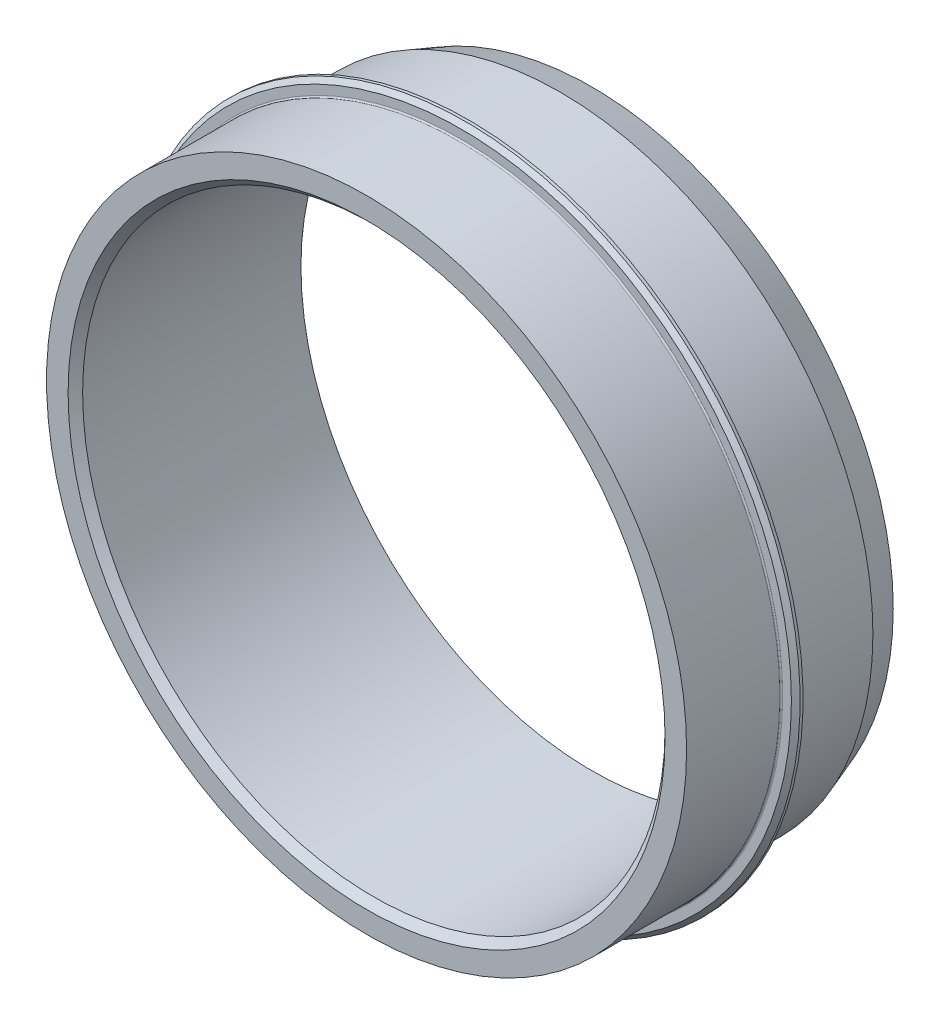
ISO-10303-21;
HEADER;
FILE_DESCRIPTION(('STEP AP214'),'2;1');
FILE_NAME('part.step','',(''),(''),'','','');
FILE_SCHEMA(('AUTOMOTIVE_DESIGN { 1 0 10303 214 1 1 1 1 }'));
ENDSEC;
DATA;
#1=APPLICATION_CONTEXT('core data for automotive mechanical design processes');
#2=APPLICATION_PROTOCOL_DEFINITION('international standard','automotive_design',2000,#1);
#3=PRODUCT_CONTEXT('',#1,'mechanical');
#4=PRODUCT('Part','Part','',(#3));
#5=PRODUCT_RELATED_PRODUCT_CATEGORY('part','',(#4));
#6=PRODUCT_DEFINITION_FORMATION('','',#4);
#7=PRODUCT_DEFINITION_CONTEXT('part definition',#1,'design');
#8=PRODUCT_DEFINITION('design','',#6,#7);
#9=PRODUCT_DEFINITION_SHAPE('','',#8);
#10=(LENGTH_UNIT() NAMED_UNIT(*) SI_UNIT(.MILLI.,.METRE.));
#11=(NAMED_UNIT(*) PLANE_ANGLE_UNIT() SI_UNIT($,.RADIAN.));
#12=(NAMED_UNIT(*) SI_UNIT($,.STERADIAN.) SOLID_ANGLE_UNIT());
#13=UNCERTAINTY_MEASURE_WITH_UNIT(LENGTH_MEASURE(1.E-05),#10,'distance_accuracy_value','');
#14=(GEOMETRIC_REPRESENTATION_CONTEXT(3) GLOBAL_UNCERTAINTY_ASSIGNED_CONTEXT((#13)) GLOBAL_UNIT_ASSIGNED_CONTEXT((#10,
#11,#12)) REPRESENTATION_CONTEXT('',''));
#15=CARTESIAN_POINT('',(0.,0.,0.));
#16=DIRECTION('',(0.,0.,1.));
#17=DIRECTION('',(1.,0.,0.));
#18=AXIS2_PLACEMENT_3D('',#15,#16,#17);
#19=CARTESIAN_POINT('',(0.,34.23,479.8));
#20=DIRECTION('',(0.,0.,1.));
#21=DIRECTION('',(-1.,0.,0.));
#22=AXIS2_PLACEMENT_3D('',#19,#20,#21);
#23=PLANE('',#22);
#24=CARTESIAN_POINT('',(0.,-11.75,479.8));
#25=DIRECTION('',(0.,0.,-1.));
#26=DIRECTION('',(1.,0.,0.));
#27=AXIS2_PLACEMENT_3D('',#24,#25,#26);
#28=CIRCLE('',#27,44.18);
#29=CARTESIAN_POINT('',(44.18,-11.75,479.8));
#30=VERTEX_POINT('',#29);
#31=EDGE_CURVE('E102',#30,#30,#28,.T.);
#32=ORIENTED_EDGE('',*,*,#31,.T.);
#33=EDGE_LOOP('',(#32));
#34=FACE_BOUND('',#33,.T.);
#35=CARTESIAN_POINT('',(0.,-11.75,479.8));
#36=DIRECTION('',(0.,0.,1.));
#37=DIRECTION('',(1.,0.,0.));
#38=AXIS2_PLACEMENT_3D('',#35,#36,#37);
#39=CIRCLE('',#38,45.38);
#40=CARTESIAN_POINT('',(-45.38,-11.75,479.8));
#41=VERTEX_POINT('',#40);
#42=EDGE_CURVE('E95',#41,#41,#39,.T.);
#43=ORIENTED_EDGE('',*,*,#42,.T.);
#44=EDGE_LOOP('',(#43));
#45=FACE_BOUND('',#44,.T.);
#46=ADVANCED_FACE('F17',(#34,#45),#23,.T.);
#47=CARTESIAN_POINT('',(0.,31.23,478.8));
#48=DIRECTION('',(0.,0.,-1.));
#49=DIRECTION('',(0.,-1.,0.));
#50=AXIS2_PLACEMENT_3D('',#47,#48,#49);
#51=PLANE('',#50);
#52=CARTESIAN_POINT('',(0.,-11.75,478.8));
#53=DIRECTION('',(0.,0.,-1.));
#54=DIRECTION('',(-1.,0.,0.));
#55=AXIS2_PLACEMENT_3D('',#52,#53,#54);
#56=CIRCLE('',#55,42.98);
#57=CARTESIAN_POINT('',(42.98,-11.75,478.8));
#58=VERTEX_POINT('',#57);
#59=EDGE_CURVE('E28',#58,#58,#56,.T.);
#60=ORIENTED_EDGE('',*,*,#59,.F.);
#61=EDGE_LOOP('',(#60));
#62=FACE_BOUND('',#61,.T.);
#63=CARTESIAN_POINT('',(0.,-11.75,478.8));
#64=DIRECTION('',(0.,0.,-1.));
#65=DIRECTION('',(-1.,0.,0.));
#66=AXIS2_PLACEMENT_3D('',#63,#64,#65);
#67=CIRCLE('',#66,45.98);
#68=CARTESIAN_POINT('',(-45.98,-11.75,478.8));
#69=VERTEX_POINT('',#68);
#70=EDGE_CURVE('E86',#69,#69,#67,.T.);
#71=ORIENTED_EDGE('',*,*,#70,.T.);
#72=EDGE_LOOP('',(#71));
#73=FACE_BOUND('',#72,.T.);
#74=ADVANCED_FACE('F147',(#62,#73),#51,.T.);
#75=CARTESIAN_POINT('',(0.,28.27,461.8));
#76=DIRECTION('',(0.,0.,-1.));
#77=DIRECTION('',(0.,-1.,0.));
#78=AXIS2_PLACEMENT_3D('',#75,#76,#77);
#79=PLANE('',#78);
#80=CARTESIAN_POINT('',(0.,-11.75,461.8));
#81=DIRECTION('',(0.,0.,-1.));
#82=DIRECTION('',(-1.,0.,0.));
#83=AXIS2_PLACEMENT_3D('',#80,#81,#82);
#84=CIRCLE('',#83,40.02);
#85=CARTESIAN_POINT('',(-40.02,-11.75,461.8));
#86=VERTEX_POINT('',#85);
#87=EDGE_CURVE('E11',#86,#86,#84,.T.);
#88=ORIENTED_EDGE('',*,*,#87,.F.);
#89=EDGE_LOOP('',(#88));
#90=FACE_BOUND('',#89,.T.);
#91=CARTESIAN_POINT('',(0.,-11.75,461.8));
#92=DIRECTION('',(0.,0.,-1.));
#93=DIRECTION('',(-1.,0.,0.));
#94=AXIS2_PLACEMENT_3D('',#91,#92,#93);
#95=CIRCLE('',#94,41.38);
#96=CARTESIAN_POINT('',(41.38,-11.75,461.8));
#97=VERTEX_POINT('',#96);
#98=EDGE_CURVE('E21',#97,#97,#95,.T.);
#99=ORIENTED_EDGE('',*,*,#98,.T.);
#100=EDGE_LOOP('',(#99));
#101=FACE_BOUND('',#100,.T.);
#102=ADVANCED_FACE('F125',(#90,#101),#79,.T.);
#103=CARTESIAN_POINT('',(0.,32.23,492.8));
#104=DIRECTION('',(0.,0.,1.));
#105=DIRECTION('',(-1.,0.,0.));
#106=AXIS2_PLACEMENT_3D('',#103,#104,#105);
#107=PLANE('',#106);
#108=CARTESIAN_POINT('',(0.,-11.75,492.8));
#109=DIRECTION('',(0.,0.,-1.));
#110=DIRECTION('',(1.,0.,0.));
#111=AXIS2_PLACEMENT_3D('',#108,#109,#110);
#112=CIRCLE('',#111,41.02);
#113=CARTESIAN_POINT('',(41.02,-11.75,492.8));
#114=VERTEX_POINT('',#113);
#115=EDGE_CURVE('E106',#114,#114,#112,.T.);
#116=ORIENTED_EDGE('',*,*,#115,.T.);
#117=EDGE_LOOP('',(#116));
#118=FACE_BOUND('',#117,.T.);
#119=CARTESIAN_POINT('',(0.,-11.75,492.8));
#120=DIRECTION('',(0.,0.,-1.));
#121=DIRECTION('',(-1.,0.,0.));
#122=AXIS2_PLACEMENT_3D('',#119,#120,#121);
#123=CIRCLE('',#122,43.98);
#124=CARTESIAN_POINT('',(43.98,-11.75,492.8));
#125=VERTEX_POINT('',#124);
#126=EDGE_CURVE('E82',#125,#125,#123,.T.);
#127=ORIENTED_EDGE('',*,*,#126,.F.);
#128=EDGE_LOOP('',(#127));
#129=FACE_BOUND('',#128,.T.);
#130=ADVANCED_FACE('F159',(#118,#129),#107,.T.);
#131=CARTESIAN_POINT('',(0.,-11.75,492.8));
#132=DIRECTION('',(0.,0.,-1.));
#133=DIRECTION('',(-1.,0.,0.));
#134=AXIS2_PLACEMENT_3D('',#131,#132,#133);
#135=CYLINDRICAL_SURFACE('',#134,40.02);
#136=ORIENTED_EDGE('',*,*,#87,.T.);
#137=EDGE_LOOP('',(#136));
#138=FACE_BOUND('',#137,.T.);
#139=CARTESIAN_POINT('',(0.,-11.75,491.8));
#140=DIRECTION('',(0.,0.,1.));
#141=DIRECTION('',(1.,0.,0.));
#142=AXIS2_PLACEMENT_3D('',#139,#140,#141);
#143=CIRCLE('',#142,40.02);
#144=CARTESIAN_POINT('',(40.02,-11.75,491.8));
#145=VERTEX_POINT('',#144);
#146=EDGE_CURVE('E103',#145,#145,#143,.T.);
#147=ORIENTED_EDGE('',*,*,#146,.T.);
#148=EDGE_LOOP('',(#147));
#149=FACE_BOUND('',#148,.T.);
#150=ADVANCED_FACE('F19',(#138,#149),#135,.F.);
#151=CARTESIAN_POINT('',(0.,-11.75,492.8));
#152=DIRECTION('',(0.,0.,-1.));
#153=DIRECTION('',(-1.,0.,0.));
#154=AXIS2_PLACEMENT_3D('',#151,#152,#153);
#155=CYLINDRICAL_SURFACE('',#154,42.98);
#156=CARTESIAN_POINT('',(0.,-11.75,466.195963871127));
#157=DIRECTION('',(0.,0.,1.));
#158=DIRECTION('',(-1.,0.,0.));
#159=AXIS2_PLACEMENT_3D('',#156,#157,#158);
#160=CIRCLE('',#159,42.98);
#161=CARTESIAN_POINT('',(42.98,-11.75,466.195963871127));
#162=VERTEX_POINT('',#161);
#163=EDGE_CURVE('E97',#162,#162,#160,.T.);
#164=ORIENTED_EDGE('',*,*,#163,.T.);
#165=EDGE_LOOP('',(#164));
#166=FACE_BOUND('',#165,.T.);
#167=ORIENTED_EDGE('',*,*,#59,.T.);
#168=EDGE_LOOP('',(#167));
#169=FACE_BOUND('',#168,.T.);
#170=ADVANCED_FACE('F165',(#166,#169),#155,.T.);
#171=CARTESIAN_POINT('',(0.,-11.75,492.8));
#172=DIRECTION('',(0.,0.,-1.));
#173=DIRECTION('',(-1.,0.,0.));
#174=AXIS2_PLACEMENT_3D('',#171,#172,#173);
#175=CYLINDRICAL_SURFACE('',#174,45.98);
#176=ORIENTED_EDGE('',*,*,#70,.F.);
#177=EDGE_LOOP('',(#176));
#178=FACE_BOUND('',#177,.T.);
#179=CARTESIAN_POINT('',(0.,-11.75,479.2));
#180=DIRECTION('',(0.,0.,-1.));
#181=DIRECTION('',(1.,0.,0.));
#182=AXIS2_PLACEMENT_3D('',#179,#180,#181);
#183=CIRCLE('',#182,45.98);
#184=CARTESIAN_POINT('',(-45.98,-11.75,479.2));
#185=VERTEX_POINT('',#184);
#186=EDGE_CURVE('E87',#185,#185,#183,.T.);
#187=ORIENTED_EDGE('',*,*,#186,.T.);
#188=EDGE_LOOP('',(#187));
#189=FACE_BOUND('',#188,.T.);
#190=ADVANCED_FACE('F157',(#178,#189),#175,.T.);
#191=CARTESIAN_POINT('',(0.,-11.75,492.8));
#192=DIRECTION('',(0.,0.,-1.));
#193=DIRECTION('',(-1.,0.,0.));
#194=AXIS2_PLACEMENT_3D('',#191,#192,#193);
#195=CYLINDRICAL_SURFACE('',#194,43.98);
#196=CARTESIAN_POINT('',(0.,-11.75,480.));
#197=DIRECTION('',(0.,0.,1.));
#198=DIRECTION('',(1.,0.,0.));
#199=AXIS2_PLACEMENT_3D('',#196,#197,#198);
#200=CIRCLE('',#199,43.98);
#201=CARTESIAN_POINT('',(43.98,-11.75,480.));
#202=VERTEX_POINT('',#201);
#203=EDGE_CURVE('E99',#202,#202,#200,.T.);
#204=ORIENTED_EDGE('',*,*,#203,.T.);
#205=EDGE_LOOP('',(#204));
#206=FACE_BOUND('',#205,.T.);
#207=ORIENTED_EDGE('',*,*,#126,.T.);
#208=EDGE_LOOP('',(#207));
#209=FACE_BOUND('',#208,.T.);
#210=ADVANCED_FACE('F83',(#206,#209),#195,.T.);
#211=CARTESIAN_POINT('',(0.,-11.75,479.2));
#212=DIRECTION('',(0.,0.,-1.));
#213=DIRECTION('',(-1.,0.,0.));
#214=AXIS2_PLACEMENT_3D('',#211,#212,#213);
#215=CONICAL_SURFACE('',#214,45.98,0.785398163397448);
#216=ORIENTED_EDGE('',*,*,#186,.F.);
#217=EDGE_LOOP('',(#216));
#218=FACE_BOUND('',#217,.T.);
#219=ORIENTED_EDGE('',*,*,#42,.F.);
#220=EDGE_LOOP('',(#219));
#221=FACE_BOUND('',#220,.T.);
#222=ADVANCED_FACE('F140',(#218,#221),#215,.T.);
#223=CARTESIAN_POINT('',(0.,-11.75,480.));
#224=DIRECTION('',(0.,0.,1.));
#225=DIRECTION('',(1.,0.,0.));
#226=AXIS2_PLACEMENT_3D('',#223,#224,#225);
#227=TOROIDAL_SURFACE('',#226,44.18,0.2);
#228=ORIENTED_EDGE('',*,*,#31,.F.);
#229=EDGE_LOOP('',(#228));
#230=FACE_BOUND('',#229,.T.);
#231=ORIENTED_EDGE('',*,*,#203,.F.);
#232=EDGE_LOOP('',(#231));
#233=FACE_BOUND('',#232,.T.);
#234=ADVANCED_FACE('F130',(#230,#233),#227,.F.);
#235=CARTESIAN_POINT('',(0.,-11.75,461.8));
#236=DIRECTION('',(0.,0.,1.));
#237=DIRECTION('',(1.,0.,0.));
#238=AXIS2_PLACEMENT_3D('',#235,#236,#237);
#239=CONICAL_SURFACE('',#238,41.38,0.349065850398867);
#240=ORIENTED_EDGE('',*,*,#163,.F.);
#241=EDGE_LOOP('',(#240));
#242=FACE_BOUND('',#241,.T.);
#243=ORIENTED_EDGE('',*,*,#98,.F.);
#244=EDGE_LOOP('',(#243));
#245=FACE_BOUND('',#244,.T.);
#246=ADVANCED_FACE('F127',(#242,#245),#239,.T.);
#247=CARTESIAN_POINT('',(0.,-11.75,492.8));
#248=DIRECTION('',(0.,0.,1.));
#249=DIRECTION('',(1.,0.,0.));
#250=AXIS2_PLACEMENT_3D('',#247,#248,#249);
#251=CONICAL_SURFACE('',#250,41.02,0.785398163397438);
#252=ORIENTED_EDGE('',*,*,#115,.F.);
#253=EDGE_LOOP('',(#252));
#254=FACE_BOUND('',#253,.T.);
#255=ORIENTED_EDGE('',*,*,#146,.F.);
#256=EDGE_LOOP('',(#255));
#257=FACE_BOUND('',#256,.T.);
#258=ADVANCED_FACE('F129',(#254,#257),#251,.F.);
#259=CLOSED_SHELL('',(#46,#74,#102,#130,#150,#170,#190,#210,#222,#234,#246,#258));
#260=MANIFOLD_SOLID_BREP('B1',#259);
#261=ADVANCED_BREP_SHAPE_REPRESENTATION('',(#18,#260),#14);
#262=SHAPE_DEFINITION_REPRESENTATION(#9,#261);
ENDSEC;
END-ISO-10303-21;
